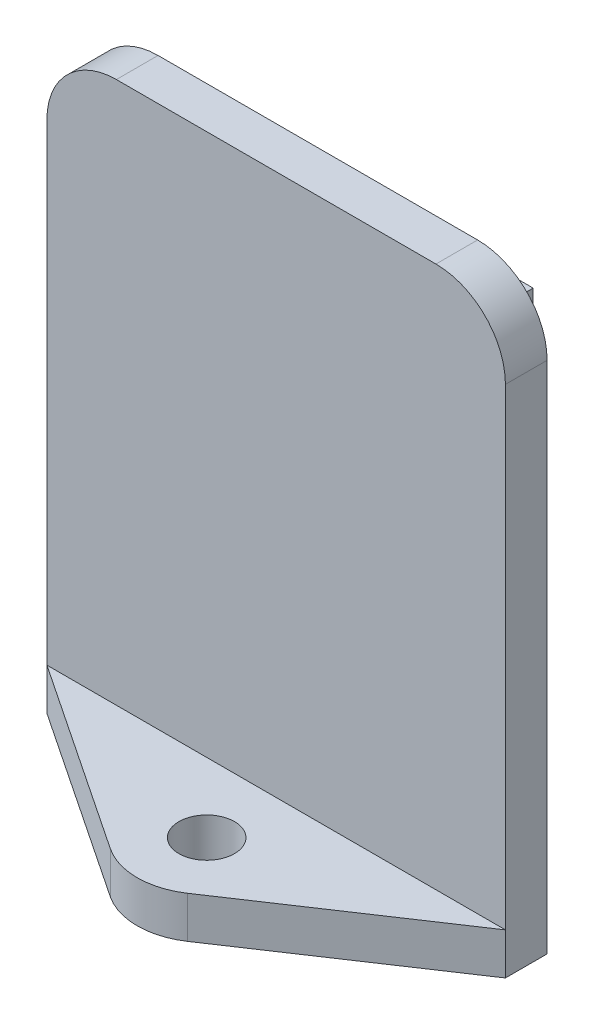
ISO-10303-21;
HEADER;
FILE_DESCRIPTION(('STEP AP214'),'2;1');
FILE_NAME('part.step','',(''),(''),'','','');
FILE_SCHEMA(('AUTOMOTIVE_DESIGN { 1 0 10303 214 1 1 1 1 }'));
ENDSEC;
DATA;
#1=APPLICATION_CONTEXT('core data for automotive mechanical design processes');
#2=APPLICATION_PROTOCOL_DEFINITION('international standard','automotive_design',2000,#1);
#3=PRODUCT_CONTEXT('',#1,'mechanical');
#4=PRODUCT('Part','Part','',(#3));
#5=PRODUCT_RELATED_PRODUCT_CATEGORY('part','',(#4));
#6=PRODUCT_DEFINITION_FORMATION('','',#4);
#7=PRODUCT_DEFINITION_CONTEXT('part definition',#1,'design');
#8=PRODUCT_DEFINITION('design','',#6,#7);
#9=PRODUCT_DEFINITION_SHAPE('','',#8);
#10=(LENGTH_UNIT() NAMED_UNIT(*) SI_UNIT(.MILLI.,.METRE.));
#11=(NAMED_UNIT(*) PLANE_ANGLE_UNIT() SI_UNIT($,.RADIAN.));
#12=(NAMED_UNIT(*) SI_UNIT($,.STERADIAN.) SOLID_ANGLE_UNIT());
#13=UNCERTAINTY_MEASURE_WITH_UNIT(LENGTH_MEASURE(1.E-05),#10,'distance_accuracy_value','');
#14=(GEOMETRIC_REPRESENTATION_CONTEXT(3) GLOBAL_UNCERTAINTY_ASSIGNED_CONTEXT((#13)) GLOBAL_UNIT_ASSIGNED_CONTEXT((#10,
#11,#12)) REPRESENTATION_CONTEXT('',''));
#15=CARTESIAN_POINT('',(0.,0.,0.));
#16=DIRECTION('',(0.,0.,1.));
#17=DIRECTION('',(1.,0.,0.));
#18=AXIS2_PLACEMENT_3D('',#15,#16,#17);
#19=CARTESIAN_POINT('',(11.5,18.5,3.));
#20=DIRECTION('',(0.,0.,-1.));
#21=DIRECTION('',(-1.,0.,0.));
#22=AXIS2_PLACEMENT_3D('',#19,#20,#21);
#23=PLANE('',#22);
#24=DIRECTION('',(-1.,0.,0.));
#25=VECTOR('',#24,1.);
#26=CARTESIAN_POINT('',(0.,-15.5,3.));
#27=LINE('',#26,#25);
#28=CARTESIAN_POINT('',(16.5,-15.5,3.));
#29=VERTEX_POINT('',#28);
#30=CARTESIAN_POINT('',(-16.5,-15.5,3.));
#31=VERTEX_POINT('',#30);
#32=EDGE_CURVE('E190',#29,#31,#27,.T.);
#33=ORIENTED_EDGE('',*,*,#32,.F.);
#34=DIRECTION('',(0.,1.,0.));
#35=VECTOR('',#34,1.);
#36=CARTESIAN_POINT('',(16.5,18.5,3.));
#37=LINE('',#36,#35);
#38=CARTESIAN_POINT('',(16.5,18.5,3.));
#39=VERTEX_POINT('',#38);
#40=EDGE_CURVE('E218',#29,#39,#37,.T.);
#41=ORIENTED_EDGE('',*,*,#40,.T.);
#42=CARTESIAN_POINT('',(11.5,18.5,3.));
#43=DIRECTION('',(0.,0.,1.));
#44=DIRECTION('',(-1.,0.,0.));
#45=AXIS2_PLACEMENT_3D('',#42,#43,#44);
#46=CIRCLE('',#45,5.);
#47=CARTESIAN_POINT('',(11.5,23.5,3.));
#48=VERTEX_POINT('',#47);
#49=EDGE_CURVE('E224',#39,#48,#46,.T.);
#50=ORIENTED_EDGE('',*,*,#49,.T.);
#51=DIRECTION('',(-1.,0.,0.));
#52=VECTOR('',#51,1.);
#53=CARTESIAN_POINT('',(11.5,23.5,3.));
#54=LINE('',#53,#52);
#55=CARTESIAN_POINT('',(-11.5,23.5,3.));
#56=VERTEX_POINT('',#55);
#57=EDGE_CURVE('E227',#48,#56,#54,.T.);
#58=ORIENTED_EDGE('',*,*,#57,.T.);
#59=CARTESIAN_POINT('',(-11.5,18.5,3.));
#60=DIRECTION('',(0.,0.,1.));
#61=DIRECTION('',(1.,0.,0.));
#62=AXIS2_PLACEMENT_3D('',#59,#60,#61);
#63=CIRCLE('',#62,5.);
#64=CARTESIAN_POINT('',(-16.5,18.5,3.));
#65=VERTEX_POINT('',#64);
#66=EDGE_CURVE('E230',#56,#65,#63,.T.);
#67=ORIENTED_EDGE('',*,*,#66,.T.);
#68=DIRECTION('',(0.,-1.,0.));
#69=VECTOR('',#68,1.);
#70=CARTESIAN_POINT('',(-16.5,18.5,3.));
#71=LINE('',#70,#69);
#72=EDGE_CURVE('E215',#65,#31,#71,.T.);
#73=ORIENTED_EDGE('',*,*,#72,.T.);
#74=EDGE_LOOP('',(#33,#41,#50,#58,#67,#73));
#75=FACE_BOUND('',#74,.T.);
#76=ADVANCED_FACE('F41',(#75),#23,.F.);
#77=CARTESIAN_POINT('',(-16.5,18.5,3.));
#78=DIRECTION('',(1.,0.,0.));
#79=DIRECTION('',(0.,1.,0.));
#80=AXIS2_PLACEMENT_3D('',#77,#78,#79);
#81=PLANE('',#80);
#82=DIRECTION('',(0.,-1.,0.));
#83=VECTOR('',#82,1.);
#84=CARTESIAN_POINT('',(-16.5,18.5,0.));
#85=LINE('',#84,#83);
#86=CARTESIAN_POINT('',(-16.5,18.5,0.));
#87=VERTEX_POINT('',#86);
#88=CARTESIAN_POINT('',(-16.5,-18.5,0.));
#89=VERTEX_POINT('',#88);
#90=EDGE_CURVE('E209',#87,#89,#85,.T.);
#91=ORIENTED_EDGE('',*,*,#90,.T.);
#92=DIRECTION('',(0.,0.,-1.));
#93=VECTOR('',#92,1.);
#94=CARTESIAN_POINT('',(-16.5,-18.5,3.));
#95=LINE('',#94,#93);
#96=CARTESIAN_POINT('',(-16.5,-18.5,3.));
#97=VERTEX_POINT('',#96);
#98=EDGE_CURVE('E11',#97,#89,#95,.T.);
#99=ORIENTED_EDGE('',*,*,#98,.F.);
#100=DIRECTION('',(0.,-1.,0.));
#101=VECTOR('',#100,1.);
#102=CARTESIAN_POINT('',(-16.5,-15.5,3.));
#103=LINE('',#102,#101);
#104=EDGE_CURVE('E205',#31,#97,#103,.T.);
#105=ORIENTED_EDGE('',*,*,#104,.F.);
#106=ORIENTED_EDGE('',*,*,#72,.F.);
#107=DIRECTION('',(0.,0.,-1.));
#108=VECTOR('',#107,1.);
#109=CARTESIAN_POINT('',(-16.5,18.5,3.));
#110=LINE('',#109,#108);
#111=EDGE_CURVE('E233',#65,#87,#110,.T.);
#112=ORIENTED_EDGE('',*,*,#111,.T.);
#113=EDGE_LOOP('',(#91,#99,#105,#106,#112));
#114=FACE_BOUND('',#113,.T.);
#115=ADVANCED_FACE('F43',(#114),#81,.F.);
#116=CARTESIAN_POINT('',(16.5,-18.5,3.));
#117=DIRECTION('',(0.,1.,0.));
#118=DIRECTION('',(-1.,0.,0.));
#119=AXIS2_PLACEMENT_3D('',#116,#117,#118);
#120=PLANE('',#119);
#121=DIRECTION('',(1.,0.,0.));
#122=VECTOR('',#121,1.);
#123=CARTESIAN_POINT('',(16.5,-18.5,0.));
#124=LINE('',#123,#122);
#125=CARTESIAN_POINT('',(-13.5,-18.5,0.));
#126=VERTEX_POINT('',#125);
#127=EDGE_CURVE('E237',#89,#126,#124,.T.);
#128=ORIENTED_EDGE('',*,*,#127,.T.);
#129=DIRECTION('',(0.,0.,1.));
#130=VECTOR('',#129,1.);
#131=CARTESIAN_POINT('',(-13.5,-18.5,-2.));
#132=LINE('',#131,#130);
#133=CARTESIAN_POINT('',(-13.5,-18.5,-2.));
#134=VERTEX_POINT('',#133);
#135=EDGE_CURVE('E143',#134,#126,#132,.T.);
#136=ORIENTED_EDGE('',*,*,#135,.F.);
#137=DIRECTION('',(-1.,0.,0.));
#138=VECTOR('',#137,1.);
#139=CARTESIAN_POINT('',(13.5,-18.5,-2.));
#140=LINE('',#139,#138);
#141=CARTESIAN_POINT('',(13.5,-18.5,-2.));
#142=VERTEX_POINT('',#141);
#143=EDGE_CURVE('E135',#142,#134,#140,.T.);
#144=ORIENTED_EDGE('',*,*,#143,.F.);
#145=DIRECTION('',(0.,0.,1.));
#146=VECTOR('',#145,1.);
#147=CARTESIAN_POINT('',(13.5,-18.5,-2.));
#148=LINE('',#147,#146);
#149=CARTESIAN_POINT('',(13.5,-18.5,0.));
#150=VERTEX_POINT('',#149);
#151=EDGE_CURVE('E141',#142,#150,#148,.T.);
#152=ORIENTED_EDGE('',*,*,#151,.T.);
#153=CARTESIAN_POINT('',(16.5,-18.5,0.));
#154=VERTEX_POINT('',#153);
#155=EDGE_CURVE('E62',#150,#154,#124,.T.);
#156=ORIENTED_EDGE('',*,*,#155,.T.);
#157=DIRECTION('',(0.,0.,-1.));
#158=VECTOR('',#157,1.);
#159=CARTESIAN_POINT('',(16.5,-18.5,3.));
#160=LINE('',#159,#158);
#161=CARTESIAN_POINT('',(16.5,-18.5,3.));
#162=VERTEX_POINT('',#161);
#163=EDGE_CURVE('E50',#162,#154,#160,.T.);
#164=ORIENTED_EDGE('',*,*,#163,.F.);
#165=DIRECTION('',(0.831791421362489,0.,-0.555088309503785));
#166=VECTOR('',#165,1.);
#167=CARTESIAN_POINT('',(6.46918309906976,-18.5,9.69397285603029));
#168=LINE('',#167,#166);
#169=CARTESIAN_POINT('',(2.77544154751892,-18.5,12.1589571068125));
#170=VERTEX_POINT('',#169);
#171=EDGE_CURVE('E167',#170,#162,#168,.T.);
#172=ORIENTED_EDGE('',*,*,#171,.F.);
#173=CARTESIAN_POINT('',(0.,-18.5,8.));
#174=DIRECTION('',(0.,-1.,0.));
#175=DIRECTION('',(0.,0.,-1.));
#176=AXIS2_PLACEMENT_3D('',#173,#174,#175);
#177=CIRCLE('',#176,5.);
#178=CARTESIAN_POINT('',(-2.77544154751893,-18.5,12.1589571068125));
#179=VERTEX_POINT('',#178);
#180=EDGE_CURVE('E198',#170,#179,#177,.T.);
#181=ORIENTED_EDGE('',*,*,#180,.T.);
#182=DIRECTION('',(-0.83179142136249,0.,-0.555088309503785));
#183=VECTOR('',#182,1.);
#184=CARTESIAN_POINT('',(-6.46918309906976,-18.5,9.6939728560303));
#185=LINE('',#184,#183);
#186=EDGE_CURVE('E178',#179,#97,#185,.T.);
#187=ORIENTED_EDGE('',*,*,#186,.T.);
#188=ORIENTED_EDGE('',*,*,#98,.T.);
#189=EDGE_LOOP('',(#128,#136,#144,#152,#156,#164,#172,#181,#187,#188));
#190=FACE_BOUND('',#189,.T.);
#191=CARTESIAN_POINT('',(0.,-18.5,8.));
#192=DIRECTION('',(0.,-1.,0.));
#193=DIRECTION('',(0.,0.,-1.));
#194=AXIS2_PLACEMENT_3D('',#191,#192,#193);
#195=CIRCLE('',#194,2.);
#196=CARTESIAN_POINT('',(0.,-18.5,6.));
#197=VERTEX_POINT('',#196);
#198=EDGE_CURVE('E162',#197,#197,#195,.T.);
#199=ORIENTED_EDGE('',*,*,#198,.F.);
#200=EDGE_LOOP('',(#199));
#201=FACE_BOUND('',#200,.T.);
#202=ADVANCED_FACE('F138',(#190,#201),#120,.F.);
#203=CARTESIAN_POINT('',(16.5,18.5,3.));
#204=DIRECTION('',(-1.,0.,0.));
#205=DIRECTION('',(0.,-1.,0.));
#206=AXIS2_PLACEMENT_3D('',#203,#204,#205);
#207=PLANE('',#206);
#208=DIRECTION('',(0.,1.,0.));
#209=VECTOR('',#208,1.);
#210=CARTESIAN_POINT('',(16.5,18.5,0.));
#211=LINE('',#210,#209);
#212=CARTESIAN_POINT('',(16.5,18.5,0.));
#213=VERTEX_POINT('',#212);
#214=EDGE_CURVE('E240',#154,#213,#211,.T.);
#215=ORIENTED_EDGE('',*,*,#214,.T.);
#216=DIRECTION('',(0.,0.,-1.));
#217=VECTOR('',#216,1.);
#218=CARTESIAN_POINT('',(16.5,18.5,3.));
#219=LINE('',#218,#217);
#220=EDGE_CURVE('E262',#39,#213,#219,.T.);
#221=ORIENTED_EDGE('',*,*,#220,.F.);
#222=ORIENTED_EDGE('',*,*,#40,.F.);
#223=EDGE_CURVE('E220',#162,#29,#37,.T.);
#224=ORIENTED_EDGE('',*,*,#223,.F.);
#225=ORIENTED_EDGE('',*,*,#163,.T.);
#226=EDGE_LOOP('',(#215,#221,#222,#224,#225));
#227=FACE_BOUND('',#226,.T.);
#228=ADVANCED_FACE('F269',(#227),#207,.F.);
#229=CARTESIAN_POINT('',(11.5,18.5,3.));
#230=DIRECTION('',(0.,0.,-1.));
#231=DIRECTION('',(-1.,0.,0.));
#232=AXIS2_PLACEMENT_3D('',#229,#230,#231);
#233=CYLINDRICAL_SURFACE('',#232,5.);
#234=CARTESIAN_POINT('',(11.5,18.5,0.));
#235=DIRECTION('',(0.,0.,1.));
#236=DIRECTION('',(-1.,0.,0.));
#237=AXIS2_PLACEMENT_3D('',#234,#235,#236);
#238=CIRCLE('',#237,5.);
#239=CARTESIAN_POINT('',(11.5,23.5,0.));
#240=VERTEX_POINT('',#239);
#241=EDGE_CURVE('E243',#213,#240,#238,.T.);
#242=ORIENTED_EDGE('',*,*,#241,.T.);
#243=DIRECTION('',(0.,0.,-1.));
#244=VECTOR('',#243,1.);
#245=CARTESIAN_POINT('',(11.5,23.5,3.));
#246=LINE('',#245,#244);
#247=EDGE_CURVE('E258',#48,#240,#246,.T.);
#248=ORIENTED_EDGE('',*,*,#247,.F.);
#249=ORIENTED_EDGE('',*,*,#49,.F.);
#250=ORIENTED_EDGE('',*,*,#220,.T.);
#251=EDGE_LOOP('',(#242,#248,#249,#250));
#252=FACE_BOUND('',#251,.T.);
#253=ADVANCED_FACE('F279',(#252),#233,.T.);
#254=CARTESIAN_POINT('',(11.5,23.5,3.));
#255=DIRECTION('',(0.,-1.,0.));
#256=DIRECTION('',(0.,0.,-1.));
#257=AXIS2_PLACEMENT_3D('',#254,#255,#256);
#258=PLANE('',#257);
#259=DIRECTION('',(-1.,0.,0.));
#260=VECTOR('',#259,1.);
#261=CARTESIAN_POINT('',(11.5,23.5,0.));
#262=LINE('',#261,#260);
#263=CARTESIAN_POINT('',(-11.5,23.5,0.));
#264=VERTEX_POINT('',#263);
#265=EDGE_CURVE('E246',#240,#264,#262,.T.);
#266=ORIENTED_EDGE('',*,*,#265,.T.);
#267=DIRECTION('',(0.,0.,-1.));
#268=VECTOR('',#267,1.);
#269=CARTESIAN_POINT('',(-11.5,23.5,3.));
#270=LINE('',#269,#268);
#271=EDGE_CURVE('E254',#56,#264,#270,.T.);
#272=ORIENTED_EDGE('',*,*,#271,.F.);
#273=ORIENTED_EDGE('',*,*,#57,.F.);
#274=ORIENTED_EDGE('',*,*,#247,.T.);
#275=EDGE_LOOP('',(#266,#272,#273,#274));
#276=FACE_BOUND('',#275,.T.);
#277=ADVANCED_FACE('F283',(#276),#258,.F.);
#278=CARTESIAN_POINT('',(-11.5,18.5,3.));
#279=DIRECTION('',(0.,0.,-1.));
#280=DIRECTION('',(-1.,0.,0.));
#281=AXIS2_PLACEMENT_3D('',#278,#279,#280);
#282=CYLINDRICAL_SURFACE('',#281,5.);
#283=CARTESIAN_POINT('',(-11.5,18.5,0.));
#284=DIRECTION('',(0.,0.,1.));
#285=DIRECTION('',(1.,0.,0.));
#286=AXIS2_PLACEMENT_3D('',#283,#284,#285);
#287=CIRCLE('',#286,5.);
#288=EDGE_CURVE('E219',#264,#87,#287,.T.);
#289=ORIENTED_EDGE('',*,*,#288,.T.);
#290=ORIENTED_EDGE('',*,*,#111,.F.);
#291=ORIENTED_EDGE('',*,*,#66,.F.);
#292=ORIENTED_EDGE('',*,*,#271,.T.);
#293=EDGE_LOOP('',(#289,#290,#291,#292));
#294=FACE_BOUND('',#293,.T.);
#295=ADVANCED_FACE('F348',(#294),#282,.T.);
#296=CARTESIAN_POINT('',(11.5,18.5,0.));
#297=DIRECTION('',(0.,0.,-1.));
#298=DIRECTION('',(-1.,0.,0.));
#299=AXIS2_PLACEMENT_3D('',#296,#297,#298);
#300=PLANE('',#299);
#301=DIRECTION('',(0.,-1.,0.));
#302=VECTOR('',#301,1.);
#303=CARTESIAN_POINT('',(13.5,-18.5,0.));
#304=LINE('',#303,#302);
#305=CARTESIAN_POINT('',(13.5,20.5,0.));
#306=VERTEX_POINT('',#305);
#307=EDGE_CURVE('E57',#306,#150,#304,.T.);
#308=ORIENTED_EDGE('',*,*,#307,.F.);
#309=DIRECTION('',(1.,0.,0.));
#310=VECTOR('',#309,1.);
#311=CARTESIAN_POINT('',(13.5,20.5,0.));
#312=LINE('',#311,#310);
#313=CARTESIAN_POINT('',(-13.5,20.5,0.));
#314=VERTEX_POINT('',#313);
#315=EDGE_CURVE('E158',#314,#306,#312,.T.);
#316=ORIENTED_EDGE('',*,*,#315,.F.);
#317=DIRECTION('',(0.,1.,0.));
#318=VECTOR('',#317,1.);
#319=CARTESIAN_POINT('',(-13.5,-18.5,0.));
#320=LINE('',#319,#318);
#321=EDGE_CURVE('E308',#126,#314,#320,.T.);
#322=ORIENTED_EDGE('',*,*,#321,.F.);
#323=ORIENTED_EDGE('',*,*,#127,.F.);
#324=ORIENTED_EDGE('',*,*,#90,.F.);
#325=ORIENTED_EDGE('',*,*,#288,.F.);
#326=ORIENTED_EDGE('',*,*,#265,.F.);
#327=ORIENTED_EDGE('',*,*,#241,.F.);
#328=ORIENTED_EDGE('',*,*,#214,.F.);
#329=ORIENTED_EDGE('',*,*,#155,.F.);
#330=EDGE_LOOP('',(#308,#316,#322,#323,#324,#325,#326,#327,#328,#329));
#331=FACE_BOUND('',#330,.T.);
#332=ADVANCED_FACE('F274',(#331),#300,.T.);
#333=CARTESIAN_POINT('',(6.46918309906976,-15.5,9.69397285603029));
#334=DIRECTION('',(-0.555088309503785,0.,-0.83179142136249));
#335=DIRECTION('',(-0.83179142136249,0.,0.555088309503785));
#336=AXIS2_PLACEMENT_3D('',#333,#334,#335);
#337=PLANE('',#336);
#338=ORIENTED_EDGE('',*,*,#171,.T.);
#339=ORIENTED_EDGE('',*,*,#223,.T.);
#340=DIRECTION('',(0.831791421362489,0.,-0.555088309503785));
#341=VECTOR('',#340,1.);
#342=CARTESIAN_POINT('',(6.46918309906976,-15.5,9.69397285603029));
#343=LINE('',#342,#341);
#344=CARTESIAN_POINT('',(2.77544154751892,-15.5,12.1589571068125));
#345=VERTEX_POINT('',#344);
#346=EDGE_CURVE('E177',#345,#29,#343,.T.);
#347=ORIENTED_EDGE('',*,*,#346,.F.);
#348=DIRECTION('',(0.,-1.,0.));
#349=VECTOR('',#348,1.);
#350=CARTESIAN_POINT('',(2.77544154751892,-15.5,12.1589571068125));
#351=LINE('',#350,#349);
#352=EDGE_CURVE('E193',#345,#170,#351,.T.);
#353=ORIENTED_EDGE('',*,*,#352,.T.);
#354=EDGE_LOOP('',(#338,#339,#347,#353));
#355=FACE_BOUND('',#354,.T.);
#356=ADVANCED_FACE('F296',(#355),#337,.F.);
#357=CARTESIAN_POINT('',(-6.46918309906976,-15.5,9.6939728560303));
#358=DIRECTION('',(-0.555088309503785,0.,0.831791421362489));
#359=DIRECTION('',(0.83179142136249,0.,0.555088309503785));
#360=AXIS2_PLACEMENT_3D('',#357,#358,#359);
#361=PLANE('',#360);
#362=ORIENTED_EDGE('',*,*,#186,.F.);
#363=DIRECTION('',(0.,-1.,0.));
#364=VECTOR('',#363,1.);
#365=CARTESIAN_POINT('',(-2.77544154751893,-15.5,12.1589571068125));
#366=LINE('',#365,#364);
#367=CARTESIAN_POINT('',(-2.77544154751893,-15.5,12.1589571068125));
#368=VERTEX_POINT('',#367);
#369=EDGE_CURVE('E210',#368,#179,#366,.T.);
#370=ORIENTED_EDGE('',*,*,#369,.F.);
#371=DIRECTION('',(-0.83179142136249,0.,-0.555088309503785));
#372=VECTOR('',#371,1.);
#373=CARTESIAN_POINT('',(-6.46918309906976,-15.5,9.6939728560303));
#374=LINE('',#373,#372);
#375=EDGE_CURVE('E186',#368,#31,#374,.T.);
#376=ORIENTED_EDGE('',*,*,#375,.T.);
#377=ORIENTED_EDGE('',*,*,#104,.T.);
#378=EDGE_LOOP('',(#362,#370,#376,#377));
#379=FACE_BOUND('',#378,.T.);
#380=ADVANCED_FACE('F302',(#379),#361,.T.);
#381=CARTESIAN_POINT('',(0.,-15.5,8.));
#382=DIRECTION('',(0.,-1.,0.));
#383=DIRECTION('',(0.,0.,-1.));
#384=AXIS2_PLACEMENT_3D('',#381,#382,#383);
#385=CYLINDRICAL_SURFACE('',#384,2.);
#386=CARTESIAN_POINT('',(0.,-15.5,8.));
#387=DIRECTION('',(0.,-1.,0.));
#388=DIRECTION('',(0.,0.,-1.));
#389=AXIS2_PLACEMENT_3D('',#386,#387,#388);
#390=CIRCLE('',#389,2.);
#391=CARTESIAN_POINT('',(0.,-15.5,6.));
#392=VERTEX_POINT('',#391);
#393=EDGE_CURVE('E173',#392,#392,#390,.T.);
#394=ORIENTED_EDGE('',*,*,#393,.F.);
#395=EDGE_LOOP('',(#394));
#396=FACE_BOUND('',#395,.T.);
#397=ORIENTED_EDGE('',*,*,#198,.T.);
#398=EDGE_LOOP('',(#397));
#399=FACE_BOUND('',#398,.T.);
#400=ADVANCED_FACE('F344',(#396,#399),#385,.F.);
#401=CARTESIAN_POINT('',(0.,-15.5,8.));
#402=DIRECTION('',(0.,-1.,0.));
#403=DIRECTION('',(0.,0.,-1.));
#404=AXIS2_PLACEMENT_3D('',#401,#402,#403);
#405=CYLINDRICAL_SURFACE('',#404,5.);
#406=ORIENTED_EDGE('',*,*,#180,.F.);
#407=ORIENTED_EDGE('',*,*,#352,.F.);
#408=CARTESIAN_POINT('',(0.,-15.5,8.));
#409=DIRECTION('',(0.,-1.,0.));
#410=DIRECTION('',(0.,0.,-1.));
#411=AXIS2_PLACEMENT_3D('',#408,#409,#410);
#412=CIRCLE('',#411,5.);
#413=EDGE_CURVE('E182',#345,#368,#412,.T.);
#414=ORIENTED_EDGE('',*,*,#413,.T.);
#415=ORIENTED_EDGE('',*,*,#369,.T.);
#416=EDGE_LOOP('',(#406,#407,#414,#415));
#417=FACE_BOUND('',#416,.T.);
#418=ADVANCED_FACE('F299',(#417),#405,.T.);
#419=CARTESIAN_POINT('',(0.,-15.5,0.));
#420=DIRECTION('',(0.,-1.,0.));
#421=DIRECTION('',(0.,0.,-1.));
#422=AXIS2_PLACEMENT_3D('',#419,#420,#421);
#423=PLANE('',#422);
#424=ORIENTED_EDGE('',*,*,#393,.T.);
#425=EDGE_LOOP('',(#424));
#426=FACE_BOUND('',#425,.T.);
#427=ORIENTED_EDGE('',*,*,#346,.T.);
#428=ORIENTED_EDGE('',*,*,#32,.T.);
#429=ORIENTED_EDGE('',*,*,#375,.F.);
#430=ORIENTED_EDGE('',*,*,#413,.F.);
#431=EDGE_LOOP('',(#427,#428,#429,#430));
#432=FACE_BOUND('',#431,.T.);
#433=ADVANCED_FACE('F293',(#426,#432),#423,.F.);
#434=CARTESIAN_POINT('',(13.5,-18.5,-2.));
#435=DIRECTION('',(-1.,0.,0.));
#436=DIRECTION('',(0.,0.,1.));
#437=AXIS2_PLACEMENT_3D('',#434,#435,#436);
#438=PLANE('',#437);
#439=ORIENTED_EDGE('',*,*,#307,.T.);
#440=ORIENTED_EDGE('',*,*,#151,.F.);
#441=DIRECTION('',(0.,-1.,0.));
#442=VECTOR('',#441,1.);
#443=CARTESIAN_POINT('',(13.5,-18.5,-2.));
#444=LINE('',#443,#442);
#445=CARTESIAN_POINT('',(13.5,20.5,-2.));
#446=VERTEX_POINT('',#445);
#447=EDGE_CURVE('E148',#446,#142,#444,.T.);
#448=ORIENTED_EDGE('',*,*,#447,.F.);
#449=DIRECTION('',(0.,0.,1.));
#450=VECTOR('',#449,1.);
#451=CARTESIAN_POINT('',(13.5,20.5,-2.));
#452=LINE('',#451,#450);
#453=EDGE_CURVE('E320',#446,#306,#452,.T.);
#454=ORIENTED_EDGE('',*,*,#453,.T.);
#455=EDGE_LOOP('',(#439,#440,#448,#454));
#456=FACE_BOUND('',#455,.T.);
#457=ADVANCED_FACE('F160',(#456),#438,.F.);
#458=CARTESIAN_POINT('',(-13.5,-18.5,-2.));
#459=DIRECTION('',(1.,0.,0.));
#460=DIRECTION('',(0.,0.,-1.));
#461=AXIS2_PLACEMENT_3D('',#458,#459,#460);
#462=PLANE('',#461);
#463=ORIENTED_EDGE('',*,*,#321,.T.);
#464=DIRECTION('',(0.,0.,1.));
#465=VECTOR('',#464,1.);
#466=CARTESIAN_POINT('',(-13.5,20.5,-2.));
#467=LINE('',#466,#465);
#468=CARTESIAN_POINT('',(-13.5,20.5,-2.));
#469=VERTEX_POINT('',#468);
#470=EDGE_CURVE('E169',#469,#314,#467,.T.);
#471=ORIENTED_EDGE('',*,*,#470,.F.);
#472=DIRECTION('',(0.,1.,0.));
#473=VECTOR('',#472,1.);
#474=CARTESIAN_POINT('',(-13.5,-18.5,-2.));
#475=LINE('',#474,#473);
#476=EDGE_CURVE('E147',#134,#469,#475,.T.);
#477=ORIENTED_EDGE('',*,*,#476,.F.);
#478=ORIENTED_EDGE('',*,*,#135,.T.);
#479=EDGE_LOOP('',(#463,#471,#477,#478));
#480=FACE_BOUND('',#479,.T.);
#481=ADVANCED_FACE('F325',(#480),#462,.F.);
#482=CARTESIAN_POINT('',(13.5,20.5,-2.));
#483=DIRECTION('',(0.,-1.,0.));
#484=DIRECTION('',(1.,0.,0.));
#485=AXIS2_PLACEMENT_3D('',#482,#483,#484);
#486=PLANE('',#485);
#487=ORIENTED_EDGE('',*,*,#315,.T.);
#488=ORIENTED_EDGE('',*,*,#453,.F.);
#489=DIRECTION('',(1.,0.,0.));
#490=VECTOR('',#489,1.);
#491=CARTESIAN_POINT('',(13.5,20.5,-2.));
#492=LINE('',#491,#490);
#493=EDGE_CURVE('E153',#469,#446,#492,.T.);
#494=ORIENTED_EDGE('',*,*,#493,.F.);
#495=ORIENTED_EDGE('',*,*,#470,.T.);
#496=EDGE_LOOP('',(#487,#488,#494,#495));
#497=FACE_BOUND('',#496,.T.);
#498=ADVANCED_FACE('F324',(#497),#486,.F.);
#499=CARTESIAN_POINT('',(0.,0.,-2.));
#500=DIRECTION('',(0.,0.,1.));
#501=DIRECTION('',(1.,0.,0.));
#502=AXIS2_PLACEMENT_3D('',#499,#500,#501);
#503=PLANE('',#502);
#504=ORIENTED_EDGE('',*,*,#447,.T.);
#505=ORIENTED_EDGE('',*,*,#143,.T.);
#506=ORIENTED_EDGE('',*,*,#476,.T.);
#507=ORIENTED_EDGE('',*,*,#493,.T.);
#508=EDGE_LOOP('',(#504,#505,#506,#507));
#509=FACE_BOUND('',#508,.T.);
#510=ADVANCED_FACE('F151',(#509),#503,.F.);
#511=CLOSED_SHELL('',(#76,#115,#202,#228,#253,#277,#295,#332,#356,#380,#400,#418,#433,#457,#481,
#498,#510));
#512=MANIFOLD_SOLID_BREP('B2',#511);
#513=ADVANCED_BREP_SHAPE_REPRESENTATION('',(#18,#512),#14);
#514=SHAPE_DEFINITION_REPRESENTATION(#9,#513);
ENDSEC;
END-ISO-10303-21;
